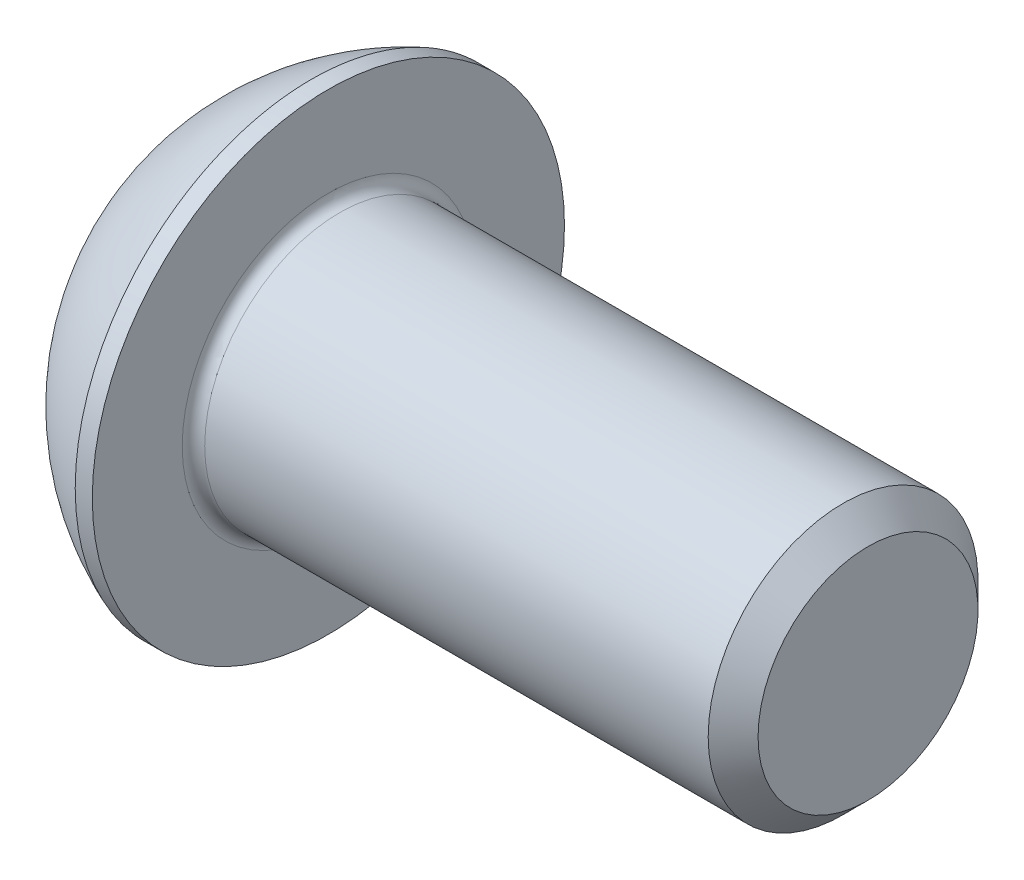
ISO-10303-21;
HEADER;
FILE_DESCRIPTION(('STEP AP214'),'2;1');
FILE_NAME('part.step','',(''),(''),'','','');
FILE_SCHEMA(('AUTOMOTIVE_DESIGN { 1 0 10303 214 1 1 1 1 }'));
ENDSEC;
DATA;
#1=APPLICATION_CONTEXT('core data for automotive mechanical design processes');
#2=APPLICATION_PROTOCOL_DEFINITION('international standard','automotive_design',2000,#1);
#3=PRODUCT_CONTEXT('',#1,'mechanical');
#4=PRODUCT('Part','Part','',(#3));
#5=PRODUCT_RELATED_PRODUCT_CATEGORY('part','',(#4));
#6=PRODUCT_DEFINITION_FORMATION('','',#4);
#7=PRODUCT_DEFINITION_CONTEXT('part definition',#1,'design');
#8=PRODUCT_DEFINITION('design','',#6,#7);
#9=PRODUCT_DEFINITION_SHAPE('','',#8);
#10=(LENGTH_UNIT() NAMED_UNIT(*) SI_UNIT(.MILLI.,.METRE.));
#11=(NAMED_UNIT(*) PLANE_ANGLE_UNIT() SI_UNIT($,.RADIAN.));
#12=(NAMED_UNIT(*) SI_UNIT($,.STERADIAN.) SOLID_ANGLE_UNIT());
#13=UNCERTAINTY_MEASURE_WITH_UNIT(LENGTH_MEASURE(1.E-05),#10,'distance_accuracy_value','');
#14=(GEOMETRIC_REPRESENTATION_CONTEXT(3) GLOBAL_UNCERTAINTY_ASSIGNED_CONTEXT((#13)) GLOBAL_UNIT_ASSIGNED_CONTEXT((#10,
#11,#12)) REPRESENTATION_CONTEXT('',''));
#15=CARTESIAN_POINT('',(0.,0.,0.));
#16=DIRECTION('',(0.,0.,1.));
#17=DIRECTION('',(1.,0.,0.));
#18=AXIS2_PLACEMENT_3D('',#15,#16,#17);
#19=CARTESIAN_POINT('',(2.08000000000008,0.,0.));
#20=DIRECTION('',(-1.,0.,0.));
#21=DIRECTION('',(0.,0.,1.));
#22=AXIS2_PLACEMENT_3D('',#19,#20,#21);
#23=CONICAL_SURFACE('',#22,1.99999999999978,1.04719755119662);
#24=CARTESIAN_POINT('',(3.23470053837915,0.,0.));
#25=VERTEX_POINT('',#24);
#26=VERTEX_LOOP('',#25);
#27=FACE_BOUND('',#26,.T.);
#28=CARTESIAN_POINT('',(2.08000000000008,0.,0.));
#29=DIRECTION('',(-1.,0.,0.));
#30=DIRECTION('',(0.,0.,1.));
#31=AXIS2_PLACEMENT_3D('',#28,#29,#30);
#32=CIRCLE('',#31,1.99999999999978);
#33=CARTESIAN_POINT('',(2.08000000000004,-1.73205080756878,0.99999999999994));
#34=VERTEX_POINT('',#33);
#35=CARTESIAN_POINT('',(2.08000000000004,0.,1.99999999999989));
#36=VERTEX_POINT('',#35);
#37=EDGE_CURVE('E96',#34,#36,#32,.T.);
#38=ORIENTED_EDGE('',*,*,#37,.T.);
#39=CARTESIAN_POINT('',(2.08000000000008,0.,0.));
#40=DIRECTION('',(-1.,0.,0.));
#41=DIRECTION('',(0.,0.,1.));
#42=AXIS2_PLACEMENT_3D('',#39,#40,#41);
#43=CIRCLE('',#42,1.99999999999978);
#44=CARTESIAN_POINT('',(2.08000000000004,1.73205080756878,0.999999999999944));
#45=VERTEX_POINT('',#44);
#46=EDGE_CURVE('E158',#36,#45,#43,.T.);
#47=ORIENTED_EDGE('',*,*,#46,.T.);
#48=CARTESIAN_POINT('',(2.08000000000008,0.,0.));
#49=DIRECTION('',(-1.,0.,0.));
#50=DIRECTION('',(0.,0.,1.));
#51=AXIS2_PLACEMENT_3D('',#48,#49,#50);
#52=CIRCLE('',#51,1.99999999999978);
#53=CARTESIAN_POINT('',(2.08000000000004,1.73205080756878,-0.999999999999943));
#54=VERTEX_POINT('',#53);
#55=EDGE_CURVE('E355',#45,#54,#52,.T.);
#56=ORIENTED_EDGE('',*,*,#55,.T.);
#57=CARTESIAN_POINT('',(2.08000000000008,0.,0.));
#58=DIRECTION('',(-1.,0.,0.));
#59=DIRECTION('',(0.,0.,1.));
#60=AXIS2_PLACEMENT_3D('',#57,#58,#59);
#61=CIRCLE('',#60,1.99999999999978);
#62=CARTESIAN_POINT('',(2.08000000000004,-1.40462971795187E-12,-1.99999999999989));
#63=VERTEX_POINT('',#62);
#64=EDGE_CURVE('E356',#54,#63,#61,.T.);
#65=ORIENTED_EDGE('',*,*,#64,.T.);
#66=CARTESIAN_POINT('',(2.08000000000008,0.,0.));
#67=DIRECTION('',(-1.,0.,0.));
#68=DIRECTION('',(0.,0.,1.));
#69=AXIS2_PLACEMENT_3D('',#66,#67,#68);
#70=CIRCLE('',#69,1.99999999999978);
#71=CARTESIAN_POINT('',(2.08000000000004,-1.73205080756878,-0.99999999999994));
#72=VERTEX_POINT('',#71);
#73=EDGE_CURVE('E99',#63,#72,#70,.T.);
#74=ORIENTED_EDGE('',*,*,#73,.T.);
#75=CARTESIAN_POINT('',(2.08000000000008,0.,0.));
#76=DIRECTION('',(-1.,0.,0.));
#77=DIRECTION('',(0.,0.,1.));
#78=AXIS2_PLACEMENT_3D('',#75,#76,#77);
#79=CIRCLE('',#78,1.99999999999978);
#80=EDGE_CURVE('E94',#72,#34,#79,.T.);
#81=ORIENTED_EDGE('',*,*,#80,.T.);
#82=EDGE_LOOP('',(#38,#47,#56,#65,#74,#81));
#83=FACE_BOUND('',#82,.T.);
#84=ADVANCED_FACE('F15',(#27,#83),#23,.F.);
#85=CARTESIAN_POINT('',(2.08,-3.46410161513774,-2.));
#86=DIRECTION('',(1.,0.,0.));
#87=DIRECTION('',(0.,0.,-1.));
#88=AXIS2_PLACEMENT_3D('',#85,#86,#87);
#89=PLANE('',#88);
#90=DIRECTION('',(0.,0.499999999999998,0.86602540378444));
#91=VECTOR('',#90,1.);
#92=CARTESIAN_POINT('',(2.08,-2.3094010767585,0.));
#93=LINE('',#92,#91);
#94=CARTESIAN_POINT('',(2.08,-1.15470053837925,2.));
#95=VERTEX_POINT('',#94);
#96=EDGE_CURVE('E108',#95,#34,#93,.F.);
#97=ORIENTED_EDGE('',*,*,#96,.F.);
#98=DIRECTION('',(0.,1.,0.));
#99=VECTOR('',#98,1.);
#100=CARTESIAN_POINT('',(2.08,-1.15470053837925,2.));
#101=LINE('',#100,#99);
#102=EDGE_CURVE('E110',#36,#95,#101,.F.);
#103=ORIENTED_EDGE('',*,*,#102,.F.);
#104=ORIENTED_EDGE('',*,*,#37,.F.);
#105=EDGE_LOOP('',(#97,#103,#104));
#106=FACE_BOUND('',#105,.T.);
#107=ADVANCED_FACE('F106',(#106),#89,.F.);
#108=CARTESIAN_POINT('',(2.08,-3.46410161513774,-2.));
#109=DIRECTION('',(1.,0.,0.));
#110=DIRECTION('',(0.,0.,-1.));
#111=AXIS2_PLACEMENT_3D('',#108,#109,#110);
#112=PLANE('',#111);
#113=DIRECTION('',(0.,-0.499999999999998,0.86602540378444));
#114=VECTOR('',#113,1.);
#115=CARTESIAN_POINT('',(2.08,-1.15470053837925,-2.));
#116=LINE('',#115,#114);
#117=CARTESIAN_POINT('',(2.08,-2.3094010767585,0.));
#118=VERTEX_POINT('',#117);
#119=EDGE_CURVE('E117',#118,#72,#116,.F.);
#120=ORIENTED_EDGE('',*,*,#119,.F.);
#121=DIRECTION('',(0.,0.499999999999998,0.86602540378444));
#122=VECTOR('',#121,1.);
#123=CARTESIAN_POINT('',(2.08,-2.3094010767585,0.));
#124=LINE('',#123,#122);
#125=EDGE_CURVE('E114',#34,#118,#124,.F.);
#126=ORIENTED_EDGE('',*,*,#125,.F.);
#127=ORIENTED_EDGE('',*,*,#80,.F.);
#128=EDGE_LOOP('',(#120,#126,#127));
#129=FACE_BOUND('',#128,.T.);
#130=ADVANCED_FACE('F115',(#129),#112,.F.);
#131=CARTESIAN_POINT('',(2.08,-3.46410161513774,-2.));
#132=DIRECTION('',(1.,0.,0.));
#133=DIRECTION('',(0.,0.,-1.));
#134=AXIS2_PLACEMENT_3D('',#131,#132,#133);
#135=PLANE('',#134);
#136=DIRECTION('',(0.,-1.,0.));
#137=VECTOR('',#136,1.);
#138=CARTESIAN_POINT('',(2.08,1.15470053837925,-2.));
#139=LINE('',#138,#137);
#140=CARTESIAN_POINT('',(2.08,-1.15470053837925,-2.));
#141=VERTEX_POINT('',#140);
#142=EDGE_CURVE('E324',#141,#63,#139,.F.);
#143=ORIENTED_EDGE('',*,*,#142,.F.);
#144=DIRECTION('',(0.,-0.499999999999998,0.86602540378444));
#145=VECTOR('',#144,1.);
#146=CARTESIAN_POINT('',(2.08,-1.15470053837925,-2.));
#147=LINE('',#146,#145);
#148=EDGE_CURVE('E336',#72,#141,#147,.F.);
#149=ORIENTED_EDGE('',*,*,#148,.F.);
#150=ORIENTED_EDGE('',*,*,#73,.F.);
#151=EDGE_LOOP('',(#143,#149,#150));
#152=FACE_BOUND('',#151,.T.);
#153=ADVANCED_FACE('F202',(#152),#135,.F.);
#154=CARTESIAN_POINT('',(2.08,-3.46410161513774,-2.));
#155=DIRECTION('',(1.,0.,0.));
#156=DIRECTION('',(0.,0.,-1.));
#157=AXIS2_PLACEMENT_3D('',#154,#155,#156);
#158=PLANE('',#157);
#159=DIRECTION('',(0.,-0.499999999999999,-0.866025403784439));
#160=VECTOR('',#159,1.);
#161=CARTESIAN_POINT('',(2.08,2.3094010767585,0.));
#162=LINE('',#161,#160);
#163=CARTESIAN_POINT('',(2.08,1.15470053837925,-2.));
#164=VERTEX_POINT('',#163);
#165=EDGE_CURVE('E309',#164,#54,#162,.F.);
#166=ORIENTED_EDGE('',*,*,#165,.F.);
#167=DIRECTION('',(0.,-1.,0.));
#168=VECTOR('',#167,1.);
#169=CARTESIAN_POINT('',(2.08,1.15470053837925,-2.));
#170=LINE('',#169,#168);
#171=EDGE_CURVE('E321',#63,#164,#170,.F.);
#172=ORIENTED_EDGE('',*,*,#171,.F.);
#173=ORIENTED_EDGE('',*,*,#64,.F.);
#174=EDGE_LOOP('',(#166,#172,#173));
#175=FACE_BOUND('',#174,.T.);
#176=ADVANCED_FACE('F198',(#175),#158,.F.);
#177=CARTESIAN_POINT('',(2.08,-3.46410161513774,-2.));
#178=DIRECTION('',(1.,0.,0.));
#179=DIRECTION('',(0.,0.,-1.));
#180=AXIS2_PLACEMENT_3D('',#177,#178,#179);
#181=PLANE('',#180);
#182=DIRECTION('',(0.,0.499999999999999,-0.866025403784439));
#183=VECTOR('',#182,1.);
#184=CARTESIAN_POINT('',(2.08,1.15470053837925,2.));
#185=LINE('',#184,#183);
#186=CARTESIAN_POINT('',(2.08,2.3094010767585,0.));
#187=VERTEX_POINT('',#186);
#188=EDGE_CURVE('E287',#187,#45,#185,.F.);
#189=ORIENTED_EDGE('',*,*,#188,.F.);
#190=DIRECTION('',(0.,-0.499999999999999,-0.866025403784439));
#191=VECTOR('',#190,1.);
#192=CARTESIAN_POINT('',(2.08,2.3094010767585,0.));
#193=LINE('',#192,#191);
#194=EDGE_CURVE('E306',#54,#187,#193,.F.);
#195=ORIENTED_EDGE('',*,*,#194,.F.);
#196=ORIENTED_EDGE('',*,*,#55,.F.);
#197=EDGE_LOOP('',(#189,#195,#196));
#198=FACE_BOUND('',#197,.T.);
#199=ADVANCED_FACE('F194',(#198),#181,.F.);
#200=CARTESIAN_POINT('',(2.08,-3.46410161513774,-2.));
#201=DIRECTION('',(1.,0.,0.));
#202=DIRECTION('',(0.,0.,-1.));
#203=AXIS2_PLACEMENT_3D('',#200,#201,#202);
#204=PLANE('',#203);
#205=DIRECTION('',(0.,1.,0.));
#206=VECTOR('',#205,1.);
#207=CARTESIAN_POINT('',(2.08,-1.15470053837925,2.));
#208=LINE('',#207,#206);
#209=CARTESIAN_POINT('',(2.08,1.15470053837925,2.));
#210=VERTEX_POINT('',#209);
#211=EDGE_CURVE('E126',#210,#36,#208,.F.);
#212=ORIENTED_EDGE('',*,*,#211,.F.);
#213=DIRECTION('',(0.,0.499999999999999,-0.866025403784439));
#214=VECTOR('',#213,1.);
#215=CARTESIAN_POINT('',(2.08,1.15470053837925,2.));
#216=LINE('',#215,#214);
#217=EDGE_CURVE('E290',#45,#210,#216,.F.);
#218=ORIENTED_EDGE('',*,*,#217,.F.);
#219=ORIENTED_EDGE('',*,*,#46,.F.);
#220=EDGE_LOOP('',(#212,#218,#219));
#221=FACE_BOUND('',#220,.T.);
#222=ADVANCED_FACE('F190',(#221),#204,.F.);
#223=CARTESIAN_POINT('',(2.08,-1.15470053837925,2.));
#224=DIRECTION('',(0.,0.,-1.));
#225=DIRECTION('',(0.,1.,0.));
#226=AXIS2_PLACEMENT_3D('',#223,#224,#225);
#227=PLANE('',#226);
#228=DIRECTION('',(0.,1.,0.));
#229=VECTOR('',#228,1.);
#230=CARTESIAN_POINT('',(0.,0.,2.));
#231=LINE('',#230,#229);
#232=CARTESIAN_POINT('',(0.,1.15470053837925,2.));
#233=VERTEX_POINT('',#232);
#234=CARTESIAN_POINT('',(0.,-1.15470053837925,2.));
#235=VERTEX_POINT('',#234);
#236=EDGE_CURVE('E283',#233,#235,#231,.F.);
#237=ORIENTED_EDGE('',*,*,#236,.F.);
#238=DIRECTION('',(1.,0.,0.));
#239=VECTOR('',#238,1.);
#240=CARTESIAN_POINT('',(2.08,1.15470053837925,2.));
#241=LINE('',#240,#239);
#242=EDGE_CURVE('E296',#210,#233,#241,.F.);
#243=ORIENTED_EDGE('',*,*,#242,.F.);
#244=ORIENTED_EDGE('',*,*,#211,.T.);
#245=ORIENTED_EDGE('',*,*,#102,.T.);
#246=DIRECTION('',(1.,0.,0.));
#247=VECTOR('',#246,1.);
#248=CARTESIAN_POINT('',(2.08,-1.15470053837925,2.));
#249=LINE('',#248,#247);
#250=EDGE_CURVE('E120',#235,#95,#249,.T.);
#251=ORIENTED_EDGE('',*,*,#250,.F.);
#252=EDGE_LOOP('',(#237,#243,#244,#245,#251));
#253=FACE_BOUND('',#252,.T.);
#254=ADVANCED_FACE('F187',(#253),#227,.T.);
#255=CARTESIAN_POINT('',(2.08,-2.3094010767585,0.));
#256=DIRECTION('',(0.,0.86602540378444,-0.499999999999998));
#257=DIRECTION('',(0.,0.499999999999998,0.86602540378444));
#258=AXIS2_PLACEMENT_3D('',#255,#256,#257);
#259=PLANE('',#258);
#260=DIRECTION('',(0.,-0.499999999999998,-0.86602540378444));
#261=VECTOR('',#260,1.);
#262=CARTESIAN_POINT('',(0.,-1.15470053837925,2.));
#263=LINE('',#262,#261);
#264=CARTESIAN_POINT('',(0.,-2.3094010767585,0.));
#265=VERTEX_POINT('',#264);
#266=EDGE_CURVE('E280',#235,#265,#263,.T.);
#267=ORIENTED_EDGE('',*,*,#266,.F.);
#268=ORIENTED_EDGE('',*,*,#250,.T.);
#269=ORIENTED_EDGE('',*,*,#96,.T.);
#270=ORIENTED_EDGE('',*,*,#125,.T.);
#271=DIRECTION('',(1.,0.,0.));
#272=VECTOR('',#271,1.);
#273=CARTESIAN_POINT('',(2.08,-2.3094010767585,0.));
#274=LINE('',#273,#272);
#275=EDGE_CURVE('E333',#265,#118,#274,.T.);
#276=ORIENTED_EDGE('',*,*,#275,.F.);
#277=EDGE_LOOP('',(#267,#268,#269,#270,#276));
#278=FACE_BOUND('',#277,.T.);
#279=ADVANCED_FACE('F124',(#278),#259,.T.);
#280=CARTESIAN_POINT('',(2.08,-1.15470053837925,-2.));
#281=DIRECTION('',(0.,0.86602540378444,0.499999999999998));
#282=DIRECTION('',(0.,-0.499999999999998,0.86602540378444));
#283=AXIS2_PLACEMENT_3D('',#280,#281,#282);
#284=PLANE('',#283);
#285=DIRECTION('',(0.,0.499999999999998,-0.86602540378444));
#286=VECTOR('',#285,1.);
#287=CARTESIAN_POINT('',(0.,-2.3094010767585,0.));
#288=LINE('',#287,#286);
#289=CARTESIAN_POINT('',(0.,-1.15470053837925,-2.));
#290=VERTEX_POINT('',#289);
#291=EDGE_CURVE('E277',#265,#290,#288,.T.);
#292=ORIENTED_EDGE('',*,*,#291,.F.);
#293=ORIENTED_EDGE('',*,*,#275,.T.);
#294=ORIENTED_EDGE('',*,*,#119,.T.);
#295=ORIENTED_EDGE('',*,*,#148,.T.);
#296=DIRECTION('',(1.,0.,0.));
#297=VECTOR('',#296,1.);
#298=CARTESIAN_POINT('',(2.08,-1.15470053837925,-2.));
#299=LINE('',#298,#297);
#300=EDGE_CURVE('E318',#290,#141,#299,.T.);
#301=ORIENTED_EDGE('',*,*,#300,.F.);
#302=EDGE_LOOP('',(#292,#293,#294,#295,#301));
#303=FACE_BOUND('',#302,.T.);
#304=ADVANCED_FACE('F180',(#303),#284,.T.);
#305=CARTESIAN_POINT('',(2.08,1.15470053837925,-2.));
#306=DIRECTION('',(0.,0.,1.));
#307=DIRECTION('',(0.,-1.,0.));
#308=AXIS2_PLACEMENT_3D('',#305,#306,#307);
#309=PLANE('',#308);
#310=DIRECTION('',(0.,1.,0.));
#311=VECTOR('',#310,1.);
#312=CARTESIAN_POINT('',(0.,0.,-2.));
#313=LINE('',#312,#311);
#314=CARTESIAN_POINT('',(0.,1.15470053837925,-2.));
#315=VERTEX_POINT('',#314);
#316=EDGE_CURVE('E274',#290,#315,#313,.T.);
#317=ORIENTED_EDGE('',*,*,#316,.F.);
#318=ORIENTED_EDGE('',*,*,#300,.T.);
#319=ORIENTED_EDGE('',*,*,#142,.T.);
#320=ORIENTED_EDGE('',*,*,#171,.T.);
#321=DIRECTION('',(1.,0.,0.));
#322=VECTOR('',#321,1.);
#323=CARTESIAN_POINT('',(2.08,1.15470053837925,-2.));
#324=LINE('',#323,#322);
#325=EDGE_CURVE('E291',#315,#164,#324,.T.);
#326=ORIENTED_EDGE('',*,*,#325,.F.);
#327=EDGE_LOOP('',(#317,#318,#319,#320,#326));
#328=FACE_BOUND('',#327,.T.);
#329=ADVANCED_FACE('F176',(#328),#309,.T.);
#330=CARTESIAN_POINT('',(2.08,2.3094010767585,0.));
#331=DIRECTION('',(0.,-0.866025403784439,0.499999999999999));
#332=DIRECTION('',(0.,-0.499999999999999,-0.866025403784439));
#333=AXIS2_PLACEMENT_3D('',#330,#331,#332);
#334=PLANE('',#333);
#335=DIRECTION('',(0.,0.499999999999999,0.866025403784439));
#336=VECTOR('',#335,1.);
#337=CARTESIAN_POINT('',(0.,1.15470053837925,-2.));
#338=LINE('',#337,#336);
#339=CARTESIAN_POINT('',(0.,2.3094010767585,0.));
#340=VERTEX_POINT('',#339);
#341=EDGE_CURVE('E271',#315,#340,#338,.T.);
#342=ORIENTED_EDGE('',*,*,#341,.F.);
#343=ORIENTED_EDGE('',*,*,#325,.T.);
#344=ORIENTED_EDGE('',*,*,#165,.T.);
#345=ORIENTED_EDGE('',*,*,#194,.T.);
#346=DIRECTION('',(1.,0.,0.));
#347=VECTOR('',#346,1.);
#348=CARTESIAN_POINT('',(2.08,2.3094010767585,0.));
#349=LINE('',#348,#347);
#350=EDGE_CURVE('E286',#340,#187,#349,.T.);
#351=ORIENTED_EDGE('',*,*,#350,.F.);
#352=EDGE_LOOP('',(#342,#343,#344,#345,#351));
#353=FACE_BOUND('',#352,.T.);
#354=ADVANCED_FACE('F172',(#353),#334,.T.);
#355=CARTESIAN_POINT('',(2.08,1.15470053837925,2.));
#356=DIRECTION('',(0.,-0.866025403784439,-0.499999999999999));
#357=DIRECTION('',(0.,0.499999999999999,-0.866025403784439));
#358=AXIS2_PLACEMENT_3D('',#355,#356,#357);
#359=PLANE('',#358);
#360=DIRECTION('',(0.,-0.499999999999999,0.866025403784439));
#361=VECTOR('',#360,1.);
#362=CARTESIAN_POINT('',(0.,2.3094010767585,0.));
#363=LINE('',#362,#361);
#364=EDGE_CURVE('E157',#340,#233,#363,.T.);
#365=ORIENTED_EDGE('',*,*,#364,.F.);
#366=ORIENTED_EDGE('',*,*,#350,.T.);
#367=ORIENTED_EDGE('',*,*,#188,.T.);
#368=ORIENTED_EDGE('',*,*,#217,.T.);
#369=ORIENTED_EDGE('',*,*,#242,.T.);
#370=EDGE_LOOP('',(#365,#366,#367,#368,#369));
#371=FACE_BOUND('',#370,.T.);
#372=ADVANCED_FACE('F168',(#371),#359,.T.);
#373=CARTESIAN_POINT('',(0.,0.,0.));
#374=DIRECTION('',(-1.,0.,0.));
#375=DIRECTION('',(0.,0.,1.));
#376=AXIS2_PLACEMENT_3D('',#373,#374,#375);
#377=PLANE('',#376);
#378=ORIENTED_EDGE('',*,*,#341,.T.);
#379=ORIENTED_EDGE('',*,*,#364,.T.);
#380=ORIENTED_EDGE('',*,*,#236,.T.);
#381=ORIENTED_EDGE('',*,*,#266,.T.);
#382=ORIENTED_EDGE('',*,*,#291,.T.);
#383=ORIENTED_EDGE('',*,*,#316,.T.);
#384=EDGE_LOOP('',(#378,#379,#380,#381,#382,#383));
#385=FACE_BOUND('',#384,.T.);
#386=CARTESIAN_POINT('',(0.,2.625,0.));
#387=CARTESIAN_POINT('',(0.,2.62499955832938,0.0737017679957858));
#388=CARTESIAN_POINT('',(0.,2.62189325309849,0.147417080682316));
#389=CARTESIAN_POINT('',(0.,2.60948822753756,0.294338288148161));
#390=CARTESIAN_POINT('',(0.,2.6001876790126,0.367544026082029));
#391=CARTESIAN_POINT('',(0.,2.57543601036019,0.513035004840176));
#392=CARTESIAN_POINT('',(-2.6072311426648E-13,2.5599751269018,0.585318595601678));
#393=CARTESIAN_POINT('',(2.60935133805922E-13,2.52300936288551,0.728366561559953));
#394=CARTESIAN_POINT('',(9.7431997514707E-13,2.50149957758485,0.799129653533025));
#395=CARTESIAN_POINT('',(1.75029027543185E-12,2.42819425341464,1.00807718397521));
#396=CARTESIAN_POINT('',(4.5857882655437E-13,2.36756253444589,1.14327151801101));
#397=CARTESIAN_POINT('',(-4.58596260920476E-13,2.22443033460786,1.40154703949273));
#398=CARTESIAN_POINT('',(0.,2.14192902241407,1.52462776622257));
#399=CARTESIAN_POINT('',(0.,2.00365309512566,1.69748953753203));
#400=CARTESIAN_POINT('',(0.,1.95510395215417,1.75318280455229));
#401=CARTESIAN_POINT('',(0.,1.85352483048048,1.86024310625805));
#402=CARTESIAN_POINT('',(0.,1.80049921710943,1.91161426031141));
#403=CARTESIAN_POINT('',(0.,1.69028347866323,2.00972940884079));
#404=CARTESIAN_POINT('',(0.,1.63309147798013,2.0564712967109));
#405=CARTESIAN_POINT('',(0.,1.51497835374508,2.14497563719664));
#406=CARTESIAN_POINT('',(0.,1.45405636955409,2.18673693401133));
#407=CARTESIAN_POINT('',(0.,1.26635973086194,2.30405597158635));
#408=CARTESIAN_POINT('',(0.,1.13453791344196,2.37175235676265));
#409=CARTESIAN_POINT('',(0.,0.861471098198147,2.48401205523039));
#410=CARTESIAN_POINT('',(0.,0.720226201035398,2.5285756155912));
#411=CARTESIAN_POINT('',(0.,0.432241375466185,2.5933691795997));
#412=CARTESIAN_POINT('',(0.,0.28550141771808,2.61359905329517));
#413=CARTESIAN_POINT('',(0.,-0.0092918526859921,2.6291300333719));
#414=CARTESIAN_POINT('',(0.,-0.157345165341961,2.62443113975316));
#415=CARTESIAN_POINT('',(0.,-0.450544044627086,2.59025683828291));
#416=CARTESIAN_POINT('',(0.,-0.595689626780467,2.56078156274735));
#417=CARTESIAN_POINT('',(0.,-0.879040677801841,2.47783635569747));
#418=CARTESIAN_POINT('',(0.,-1.01724607252731,2.42436616790436));
#419=CARTESIAN_POINT('',(0.,-1.21623116838599,2.32741919074682));
#420=CARTESIAN_POINT('',(0.,-1.28120404442784,2.29229057779007));
#421=CARTESIAN_POINT('',(0.,-1.40796307281117,2.2166871577305));
#422=CARTESIAN_POINT('',(0.,-1.46974995957924,2.17621359046356));
#423=CARTESIAN_POINT('',(0.,-1.58966519590825,2.09022273357546));
#424=CARTESIAN_POINT('',(0.,-1.6477951893382,2.04470773598143));
#425=CARTESIAN_POINT('',(0.,-1.76006154995037,1.94891373598036));
#426=CARTESIAN_POINT('',(0.,-1.81419400881819,1.89863017831414));
#427=CARTESIAN_POINT('',(0.,-1.96986824363037,1.7412549685023));
#428=CARTESIAN_POINT('',(0.,-2.06484578538561,1.62752459275252));
#429=CARTESIAN_POINT('',(0.,-2.23432442648757,1.38571875775843));
#430=CARTESIAN_POINT('',(0.,-2.30882630414599,1.25764384403277));
#431=CARTESIAN_POINT('',(0.,-2.40368138912447,1.0575557287349));
#432=CARTESIAN_POINT('',(0.,-2.43250766916849,0.98944455763857));
#433=CARTESIAN_POINT('',(0.,-2.48429984021739,0.851072742256228));
#434=CARTESIAN_POINT('',(0.,-2.50727047397559,0.780813889465589));
#435=CARTESIAN_POINT('',(0.,-2.54717287013015,0.63872916550747));
#436=CARTESIAN_POINT('',(0.,-2.56411416842497,0.566905961169355));
#437=CARTESIAN_POINT('',(0.,-2.59188855545266,0.422101578336359));
#438=CARTESIAN_POINT('',(0.,-2.6027234457789,0.34912074791982));
#439=CARTESIAN_POINT('',(0.,-2.61530833186003,0.230022336062013));
#440=CARTESIAN_POINT('',(0.,-2.61894155729338,0.184095439602529));
#441=CARTESIAN_POINT('',(0.,-2.62378752937376,0.0921141254285526));
#442=CARTESIAN_POINT('',(0.,-2.62500027602079,0.0460597077140613));
#443=CARTESIAN_POINT('',(0.,-2.62499955832939,-0.0737017679957874));
#444=CARTESIAN_POINT('',(0.,-2.6218932530985,-0.147417080682318));
#445=CARTESIAN_POINT('',(0.,-2.60948822753758,-0.294338288148163));
#446=CARTESIAN_POINT('',(0.,-2.60018767901262,-0.367544026082031));
#447=CARTESIAN_POINT('',(0.,-2.57543601036021,-0.513035004840177));
#448=CARTESIAN_POINT('',(-2.60372399235107E-13,-2.55997512690181,-0.58531859560168));
#449=CARTESIAN_POINT('',(2.60584133573755E-13,-2.52300936288552,-0.728366561559954));
#450=CARTESIAN_POINT('',(9.73009356226211E-13,-2.50149957758486,-0.799129653533027));
#451=CARTESIAN_POINT('',(1.74770936450194E-12,-2.42819425341466,-1.00807718397522));
#452=CARTESIAN_POINT('',(4.57283585942997E-13,-2.36756253444591,-1.14327151801101));
#453=CARTESIAN_POINT('',(-4.57300971066316E-13,-2.22443033460787,-1.40154703949273));
#454=CARTESIAN_POINT('',(0.,-2.14192902241408,-1.52462776622257));
#455=CARTESIAN_POINT('',(0.,-2.00365309512567,-1.69748953753203));
#456=CARTESIAN_POINT('',(0.,-1.95510395215418,-1.7531828045523));
#457=CARTESIAN_POINT('',(0.,-1.85352483048049,-1.86024310625805));
#458=CARTESIAN_POINT('',(0.,-1.80049921710945,-1.91161426031141));
#459=CARTESIAN_POINT('',(0.,-1.69028347866325,-2.00972940884079));
#460=CARTESIAN_POINT('',(0.,-1.63309147798015,-2.0564712967109));
#461=CARTESIAN_POINT('',(0.,-1.5149783537451,-2.14497563719665));
#462=CARTESIAN_POINT('',(0.,-1.4540563695541,-2.18673693401133));
#463=CARTESIAN_POINT('',(0.,-1.26635973086196,-2.30405597158635));
#464=CARTESIAN_POINT('',(0.,-1.13453791344197,-2.37175235676265));
#465=CARTESIAN_POINT('',(0.,-0.86147109819816,-2.48401205523039));
#466=CARTESIAN_POINT('',(0.,-0.720226201035411,-2.5285756155912));
#467=CARTESIAN_POINT('',(0.,-0.432241375466199,-2.5933691795997));
#468=CARTESIAN_POINT('',(0.,-0.285501417718094,-2.61359905329517));
#469=CARTESIAN_POINT('',(0.,0.00929185268597785,-2.6291300333719));
#470=CARTESIAN_POINT('',(0.,0.157345165341946,-2.62443113975316));
#471=CARTESIAN_POINT('',(0.,0.450544044627072,-2.59025683828292));
#472=CARTESIAN_POINT('',(0.,0.595689626780453,-2.56078156274735));
#473=CARTESIAN_POINT('',(0.,0.879040677801827,-2.47783635569747));
#474=CARTESIAN_POINT('',(0.,1.01724607252729,-2.42436616790436));
#475=CARTESIAN_POINT('',(0.,1.21623116838597,-2.32741919074682));
#476=CARTESIAN_POINT('',(0.,1.28120404442782,-2.29229057779007));
#477=CARTESIAN_POINT('',(0.,1.40796307281116,-2.21668715773049));
#478=CARTESIAN_POINT('',(0.,1.46974995957922,-2.17621359046355));
#479=CARTESIAN_POINT('',(0.,1.58966519590824,-2.09022273357546));
#480=CARTESIAN_POINT('',(0.,1.64779518933819,-2.04470773598143));
#481=CARTESIAN_POINT('',(0.,1.76006154995036,-1.94891373598036));
#482=CARTESIAN_POINT('',(0.,1.81419400881818,-1.89863017831414));
#483=CARTESIAN_POINT('',(0.,1.96986824363036,-1.7412549685023));
#484=CARTESIAN_POINT('',(0.,2.0648457853856,-1.62752459275252));
#485=CARTESIAN_POINT('',(0.,2.23432442648756,-1.38571875775843));
#486=CARTESIAN_POINT('',(0.,2.30882630414597,-1.25764384403276));
#487=CARTESIAN_POINT('',(0.,2.40368138912446,-1.0575557287349));
#488=CARTESIAN_POINT('',(0.,2.43250766916848,-0.989444557638568));
#489=CARTESIAN_POINT('',(0.,2.48429984021737,-0.851072742256225));
#490=CARTESIAN_POINT('',(0.,2.50727047397558,-0.780813889465587));
#491=CARTESIAN_POINT('',(0.,2.54717287013013,-0.638729165507468));
#492=CARTESIAN_POINT('',(0.,2.56411416842495,-0.566905961169352));
#493=CARTESIAN_POINT('',(0.,2.59188855545265,-0.422101578336358));
#494=CARTESIAN_POINT('',(0.,2.60272344577888,-0.349120747919818));
#495=CARTESIAN_POINT('',(0.,2.61530833186002,-0.230022336062013));
#496=CARTESIAN_POINT('',(0.,2.61894155729336,-0.184095439602528));
#497=CARTESIAN_POINT('',(0.,2.62378752937374,-0.092114125428553));
#498=CARTESIAN_POINT('',(0.,2.62500027602078,-0.0460597077140621));
#499=CARTESIAN_POINT('',(0.,2.625,0.));
#500=B_SPLINE_CURVE_WITH_KNOTS('',3,(#386,#387,#388,#389,#390,#391,#392,#393,#394,#395,#396,
#397,#398,#399,#400,#401,#402,#403,#404,#405,#406,#407,#408,#409,#410,#411,#412,#413,#414,#415,
#416,#417,#418,#419,#420,#421,#422,#423,#424,#425,#426,#427,#428,#429,#430,#431,#432,#433,#434,
#435,#436,#437,#438,#439,#440,#441,#442,#443,#444,#445,#446,#447,#448,#449,#450,#451,#452,#453,
#454,#455,#456,#457,#458,#459,#460,#461,#462,#463,#464,#465,#466,#467,#468,#469,#470,#471,#472,
#473,#474,#475,#476,#477,#478,#479,#480,#481,#482,#483,#484,#485,#486,#487,#488,#489,#490,#491,
#492,#493,#494,#495,#496,#497,#498,#499),.UNSPECIFIED.,.T.,.F.,(4,2,2,2,2,2,2,2,2,2,2,2,2,2,2,2,
2,2,2,2,2,2,2,2,2,2,2,2,2,2,2,2,2,2,2,2,2,2,2,2,2,2,2,2,2,2,2,2,2,2,2,2,2,2,2,2,4),(0.,
0.221062901660902,0.442191077683998,0.663671116098973,0.885331261658927,1.32759492505315,
1.76987540253947,1.99130541760913,2.21252194079338,2.43383867320747,2.65520666508064,
3.09748109741872,3.53975080596204,3.9820228764028,4.42429494684353,4.86656465538679,
5.30883908772493,5.53020707959814,5.75152381201232,5.97274033519655,6.1941703502661,
6.63645082775208,7.07871449114644,7.30037463670683,7.5218546751221,7.74298285114528,
7.96404575280634,8.10219837673666,8.24035100066701,8.46141390232791,8.68254207835101,
8.90402211676598,9.12568226232594,9.56794592572016,10.0102264032065,10.2316564182761,
10.4528729414604,10.6741896738745,10.8955576657476,11.3378320980857,11.780101806629,
12.2223738770698,12.6646459475105,13.1069156560538,13.5491900883919,13.7705580802652,
13.9918748126793,14.2130913358636,14.4345213509331,14.8768018284191,15.3190654918135,
15.5407256373738,15.7622056757891,15.9833338518123,16.2043967534734,16.3425493774037,
16.480702001334),.UNSPECIFIED.);
#501=CARTESIAN_POINT('',(0.,2.625,0.));
#502=VERTEX_POINT('',#501);
#503=EDGE_CURVE('E149',#502,#502,#500,.T.);
#504=ORIENTED_EDGE('',*,*,#503,.F.);
#505=EDGE_LOOP('',(#504));
#506=FACE_BOUND('',#505,.T.);
#507=ADVANCED_FACE('F164',(#385,#506),#377,.T.);
#508=CARTESIAN_POINT('',(4.99970462328768,0.,0.));
#509=DIRECTION('',(0.,1.,0.));
#510=DIRECTION('',(1.,0.,0.));
#511=AXIS2_PLACEMENT_3D('',#508,#509,#510);
#512=SPHERICAL_SURFACE('',#511,5.64691697478582);
#513=CARTESIAN_POINT('',(2.92,0.,0.));
#514=DIRECTION('',(-1.,0.,0.));
#515=DIRECTION('',(0.,0.,1.));
#516=AXIS2_PLACEMENT_3D('',#513,#514,#515);
#517=CIRCLE('',#516,5.25);
#518=CARTESIAN_POINT('',(2.92,0.,5.25));
#519=VERTEX_POINT('',#518);
#520=EDGE_CURVE('E146',#519,#519,#517,.F.);
#521=ORIENTED_EDGE('',*,*,#520,.F.);
#522=EDGE_LOOP('',(#521));
#523=FACE_BOUND('',#522,.T.);
#524=ORIENTED_EDGE('',*,*,#503,.T.);
#525=EDGE_LOOP('',(#524));
#526=FACE_BOUND('',#525,.T.);
#527=ADVANCED_FACE('F160',(#523,#526),#512,.T.);
#528=CARTESIAN_POINT('',(0.,0.,0.));
#529=DIRECTION('',(-1.,0.,0.));
#530=DIRECTION('',(0.,0.,1.));
#531=AXIS2_PLACEMENT_3D('',#528,#529,#530);
#532=CYLINDRICAL_SURFACE('',#531,5.25);
#533=ORIENTED_EDGE('',*,*,#520,.T.);
#534=EDGE_LOOP('',(#533));
#535=FACE_BOUND('',#534,.T.);
#536=CARTESIAN_POINT('',(3.3,0.,0.));
#537=DIRECTION('',(-1.,0.,0.));
#538=DIRECTION('',(0.,0.,1.));
#539=AXIS2_PLACEMENT_3D('',#536,#537,#538);
#540=CIRCLE('',#539,5.25);
#541=CARTESIAN_POINT('',(3.3,0.,5.25));
#542=VERTEX_POINT('',#541);
#543=EDGE_CURVE('E143',#542,#542,#540,.T.);
#544=ORIENTED_EDGE('',*,*,#543,.T.);
#545=EDGE_LOOP('',(#544));
#546=FACE_BOUND('',#545,.T.);
#547=ADVANCED_FACE('F369',(#535,#546),#532,.T.);
#548=CARTESIAN_POINT('',(15.3,0.,0.));
#549=DIRECTION('',(-1.,0.,0.));
#550=DIRECTION('',(0.,0.,1.));
#551=AXIS2_PLACEMENT_3D('',#548,#549,#550);
#552=PLANE('',#551);
#553=CARTESIAN_POINT('',(15.3000000000247,0.,0.));
#554=DIRECTION('',(-1.,0.,0.));
#555=DIRECTION('',(0.,0.,1.));
#556=AXIS2_PLACEMENT_3D('',#553,#554,#555);
#557=CIRCLE('',#556,2.44550000002164);
#558=CARTESIAN_POINT('',(15.3000000000247,0.,2.44550000002164));
#559=VERTEX_POINT('',#558);
#560=EDGE_CURVE('E139',#559,#559,#557,.T.);
#561=ORIENTED_EDGE('',*,*,#560,.F.);
#562=EDGE_LOOP('',(#561));
#563=FACE_BOUND('',#562,.T.);
#564=ADVANCED_FACE('F247',(#563),#552,.F.);
#565=CARTESIAN_POINT('',(3.3,2.99999999999999,0.));
#566=DIRECTION('',(-1.,0.,0.));
#567=DIRECTION('',(0.,0.,1.));
#568=AXIS2_PLACEMENT_3D('',#565,#566,#567);
#569=PLANE('',#568);
#570=ORIENTED_EDGE('',*,*,#543,.F.);
#571=EDGE_LOOP('',(#570));
#572=FACE_BOUND('',#571,.T.);
#573=CARTESIAN_POINT('',(3.3,0.,0.));
#574=DIRECTION('',(1.,0.,0.));
#575=DIRECTION('',(0.,0.,1.));
#576=AXIS2_PLACEMENT_3D('',#573,#574,#575);
#577=CIRCLE('',#576,3.24999999999999);
#578=CARTESIAN_POINT('',(3.3,0.,-3.24999999999999));
#579=VERTEX_POINT('',#578);
#580=CARTESIAN_POINT('',(3.3,0.,3.24999999999999));
#581=VERTEX_POINT('',#580);
#582=EDGE_CURVE('E142',#579,#581,#577,.F.);
#583=ORIENTED_EDGE('',*,*,#582,.T.);
#584=CARTESIAN_POINT('',(3.3,0.,0.));
#585=DIRECTION('',(1.,0.,0.));
#586=DIRECTION('',(0.,0.,-1.));
#587=AXIS2_PLACEMENT_3D('',#584,#585,#586);
#588=CIRCLE('',#587,3.24999999999999);
#589=EDGE_CURVE('E34',#581,#579,#588,.F.);
#590=ORIENTED_EDGE('',*,*,#589,.T.);
#591=EDGE_LOOP('',(#583,#590));
#592=FACE_BOUND('',#591,.T.);
#593=ADVANCED_FACE('F238',(#572,#592),#569,.F.);
#594=CARTESIAN_POINT('',(14.7455000000036,0.,0.));
#595=DIRECTION('',(-1.,0.,0.));
#596=DIRECTION('',(0.,0.,1.));
#597=AXIS2_PLACEMENT_3D('',#594,#595,#596);
#598=CONICAL_SURFACE('',#597,3.00000000004275,0.785398163397448);
#599=CARTESIAN_POINT('',(14.7455,0.,0.));
#600=DIRECTION('',(-1.,0.,0.));
#601=DIRECTION('',(0.,0.,1.));
#602=AXIS2_PLACEMENT_3D('',#599,#600,#601);
#603=CIRCLE('',#602,2.99999999999999);
#604=CARTESIAN_POINT('',(14.7455,0.,2.99999999999999));
#605=VERTEX_POINT('',#604);
#606=EDGE_CURVE('E26',#605,#605,#603,.T.);
#607=ORIENTED_EDGE('',*,*,#606,.F.);
#608=EDGE_LOOP('',(#607));
#609=FACE_BOUND('',#608,.T.);
#610=ORIENTED_EDGE('',*,*,#560,.T.);
#611=EDGE_LOOP('',(#610));
#612=FACE_BOUND('',#611,.T.);
#613=ADVANCED_FACE('F222',(#609,#612),#598,.T.);
#614=CARTESIAN_POINT('',(3.55,0.,0.));
#615=DIRECTION('',(-1.,0.,0.));
#616=DIRECTION('',(0.,0.,1.));
#617=AXIS2_PLACEMENT_3D('',#614,#615,#616);
#618=TOROIDAL_SURFACE('',#617,3.24999999999999,0.25);
#619=ORIENTED_EDGE('',*,*,#589,.F.);
#620=ORIENTED_EDGE('',*,*,#582,.F.);
#621=EDGE_LOOP('',(#619,#620));
#622=FACE_BOUND('',#621,.T.);
#623=CARTESIAN_POINT('',(3.55,0.,0.));
#624=DIRECTION('',(-1.,0.,0.));
#625=DIRECTION('',(0.,0.,1.));
#626=AXIS2_PLACEMENT_3D('',#623,#624,#625);
#627=CIRCLE('',#626,2.99999999999999);
#628=CARTESIAN_POINT('',(3.55,0.,2.99999999999999));
#629=VERTEX_POINT('',#628);
#630=EDGE_CURVE('E10',#629,#629,#627,.F.);
#631=ORIENTED_EDGE('',*,*,#630,.F.);
#632=EDGE_LOOP('',(#631));
#633=FACE_BOUND('',#632,.T.);
#634=ADVANCED_FACE('F216',(#622,#633),#618,.F.);
#635=CARTESIAN_POINT('',(0.,0.,0.));
#636=DIRECTION('',(-1.,0.,0.));
#637=DIRECTION('',(0.,0.,1.));
#638=AXIS2_PLACEMENT_3D('',#635,#636,#637);
#639=CYLINDRICAL_SURFACE('',#638,2.99999999999999);
#640=ORIENTED_EDGE('',*,*,#630,.T.);
#641=EDGE_LOOP('',(#640));
#642=FACE_BOUND('',#641,.T.);
#643=ORIENTED_EDGE('',*,*,#606,.T.);
#644=EDGE_LOOP('',(#643));
#645=FACE_BOUND('',#644,.T.);
#646=ADVANCED_FACE('F214',(#642,#645),#639,.T.);
#647=CLOSED_SHELL('',(#84,#107,#130,#153,#176,#199,#222,#254,#279,#304,#329,#354,#372,#507,#527,
#547,#564,#593,#613,#634,#646));
#648=MANIFOLD_SOLID_BREP('B1',#647);
#649=ADVANCED_BREP_SHAPE_REPRESENTATION('',(#18,#648),#14);
#650=SHAPE_DEFINITION_REPRESENTATION(#9,#649);
ENDSEC;
END-ISO-10303-21;
